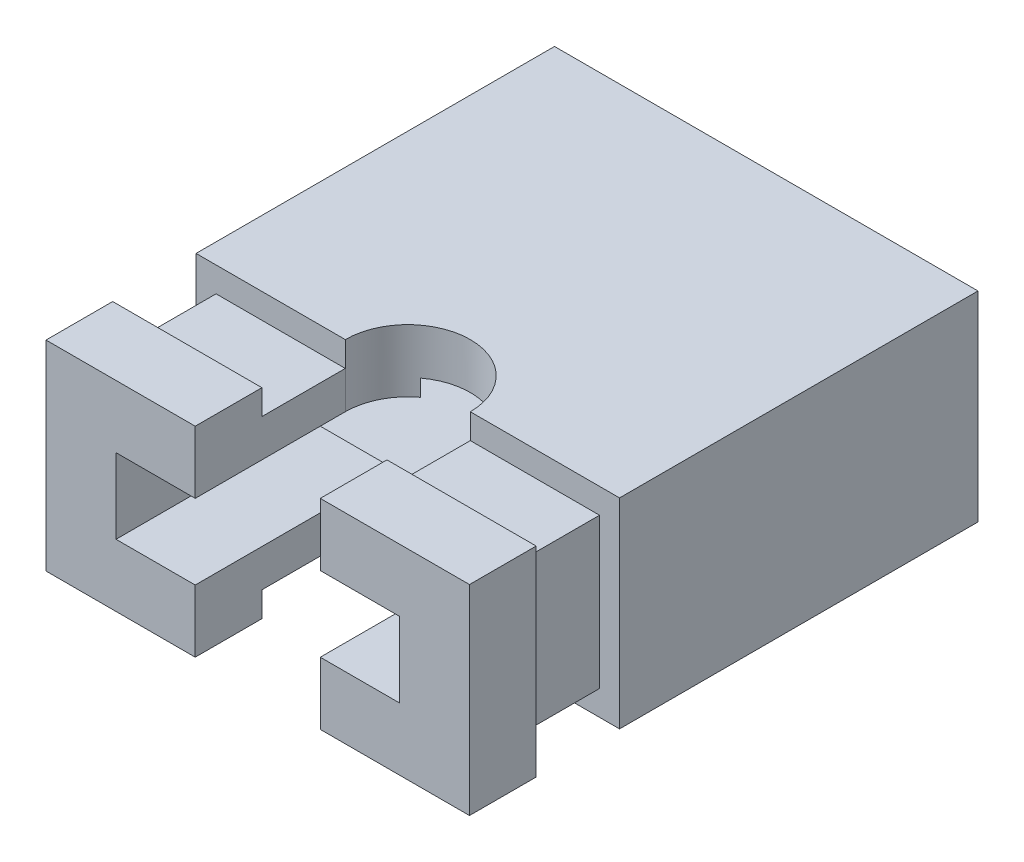
ISO-10303-21;
HEADER;
FILE_DESCRIPTION(('STEP AP214'),'2;1');
FILE_NAME('part.step','',(''),(''),'','','');
FILE_SCHEMA(('AUTOMOTIVE_DESIGN { 1 0 10303 214 1 1 1 1 }'));
ENDSEC;
DATA;
#1=APPLICATION_CONTEXT('core data for automotive mechanical design processes');
#2=APPLICATION_PROTOCOL_DEFINITION('international standard','automotive_design',2000,#1);
#3=PRODUCT_CONTEXT('',#1,'mechanical');
#4=PRODUCT('Part','Part','',(#3));
#5=PRODUCT_RELATED_PRODUCT_CATEGORY('part','',(#4));
#6=PRODUCT_DEFINITION_FORMATION('','',#4);
#7=PRODUCT_DEFINITION_CONTEXT('part definition',#1,'design');
#8=PRODUCT_DEFINITION('design','',#6,#7);
#9=PRODUCT_DEFINITION_SHAPE('','',#8);
#10=(LENGTH_UNIT() NAMED_UNIT(*) SI_UNIT(.MILLI.,.METRE.));
#11=(NAMED_UNIT(*) PLANE_ANGLE_UNIT() SI_UNIT($,.RADIAN.));
#12=(NAMED_UNIT(*) SI_UNIT($,.STERADIAN.) SOLID_ANGLE_UNIT());
#13=UNCERTAINTY_MEASURE_WITH_UNIT(LENGTH_MEASURE(1.E-05),#10,'distance_accuracy_value','');
#14=(GEOMETRIC_REPRESENTATION_CONTEXT(3) GLOBAL_UNCERTAINTY_ASSIGNED_CONTEXT((#13)) GLOBAL_UNIT_ASSIGNED_CONTEXT((#10,
#11,#12)) REPRESENTATION_CONTEXT('',''));
#15=CARTESIAN_POINT('',(0.,0.,0.));
#16=DIRECTION('',(0.,0.,1.));
#17=DIRECTION('',(1.,0.,0.));
#18=AXIS2_PLACEMENT_3D('',#15,#16,#17);
#19=CARTESIAN_POINT('',(-2.54,1.2,4.3));
#20=DIRECTION('',(0.,0.,-1.));
#21=DIRECTION('',(-1.,0.,0.));
#22=AXIS2_PLACEMENT_3D('',#19,#20,#21);
#23=PLANE('',#22);
#24=DIRECTION('',(-1.,0.,0.));
#25=VECTOR('',#24,1.);
#26=CARTESIAN_POINT('',(-2.54,1.2,4.3));
#27=LINE('',#26,#25);
#28=CARTESIAN_POINT('',(2.54,1.2,4.3));
#29=VERTEX_POINT('',#28);
#30=CARTESIAN_POINT('',(0.750000000000007,1.2,4.29999999999999));
#31=VERTEX_POINT('',#30);
#32=EDGE_CURVE('E385',#29,#31,#27,.T.);
#33=ORIENTED_EDGE('',*,*,#32,.T.);
#34=DIRECTION('',(0.,-1.,0.));
#35=VECTOR('',#34,1.);
#36=CARTESIAN_POINT('',(0.750000000000007,1.80000000000001,4.29999999999999));
#37=LINE('',#36,#35);
#38=CARTESIAN_POINT('',(0.750000000000007,0.9,4.29999999999999));
#39=VERTEX_POINT('',#38);
#40=EDGE_CURVE('E552',#31,#39,#37,.T.);
#41=ORIENTED_EDGE('',*,*,#40,.T.);
#42=DIRECTION('',(-1.,0.,0.));
#43=VECTOR('',#42,1.);
#44=CARTESIAN_POINT('',(-2.3,0.9,4.3));
#45=LINE('',#44,#43);
#46=CARTESIAN_POINT('',(2.3,0.9,4.3));
#47=VERTEX_POINT('',#46);
#48=EDGE_CURVE('E337',#47,#39,#45,.T.);
#49=ORIENTED_EDGE('',*,*,#48,.F.);
#50=DIRECTION('',(0.,1.,0.));
#51=VECTOR('',#50,1.);
#52=CARTESIAN_POINT('',(2.3,0.9,4.3));
#53=LINE('',#52,#51);
#54=CARTESIAN_POINT('',(2.3,-0.9,4.3));
#55=VERTEX_POINT('',#54);
#56=EDGE_CURVE('E333',#55,#47,#53,.T.);
#57=ORIENTED_EDGE('',*,*,#56,.F.);
#58=DIRECTION('',(1.,0.,0.));
#59=VECTOR('',#58,1.);
#60=CARTESIAN_POINT('',(2.3,-0.899999999999999,4.3));
#61=LINE('',#60,#59);
#62=CARTESIAN_POINT('',(0.750000000000007,-0.9,4.29999999999999));
#63=VERTEX_POINT('',#62);
#64=EDGE_CURVE('E329',#63,#55,#61,.T.);
#65=ORIENTED_EDGE('',*,*,#64,.F.);
#66=CARTESIAN_POINT('',(0.750000000000007,-1.19999999999999,4.29999999999999));
#67=VERTEX_POINT('',#66);
#68=EDGE_CURVE('E548',#63,#67,#37,.T.);
#69=ORIENTED_EDGE('',*,*,#68,.T.);
#70=DIRECTION('',(1.,0.,0.));
#71=VECTOR('',#70,1.);
#72=CARTESIAN_POINT('',(2.54,-1.19999999999999,4.3));
#73=LINE('',#72,#71);
#74=CARTESIAN_POINT('',(2.54,-1.19999999999999,4.3));
#75=VERTEX_POINT('',#74);
#76=EDGE_CURVE('E378',#67,#75,#73,.T.);
#77=ORIENTED_EDGE('',*,*,#76,.T.);
#78=DIRECTION('',(0.,1.,0.));
#79=VECTOR('',#78,1.);
#80=CARTESIAN_POINT('',(2.54,1.2,4.3));
#81=LINE('',#80,#79);
#82=EDGE_CURVE('E382',#75,#29,#81,.T.);
#83=ORIENTED_EDGE('',*,*,#82,.T.);
#84=EDGE_LOOP('',(#33,#41,#49,#57,#65,#69,#77,#83));
#85=FACE_BOUND('',#84,.T.);
#86=ADVANCED_FACE('F34',(#85),#23,.F.);
#87=CARTESIAN_POINT('',(2.3,-0.899999999999999,5.3));
#88=DIRECTION('',(0.,1.,0.));
#89=DIRECTION('',(-1.,0.,0.));
#90=AXIS2_PLACEMENT_3D('',#87,#88,#89);
#91=PLANE('',#90);
#92=DIRECTION('',(1.,0.,0.));
#93=VECTOR('',#92,1.);
#94=CARTESIAN_POINT('',(2.3,-0.899999999999999,5.3));
#95=LINE('',#94,#93);
#96=CARTESIAN_POINT('',(0.750000000000006,-0.9,5.3));
#97=VERTEX_POINT('',#96);
#98=CARTESIAN_POINT('',(2.3,-0.899999999999999,5.3));
#99=VERTEX_POINT('',#98);
#100=EDGE_CURVE('E343',#97,#99,#95,.T.);
#101=ORIENTED_EDGE('',*,*,#100,.F.);
#102=DIRECTION('',(0.,0.,-1.));
#103=VECTOR('',#102,1.);
#104=CARTESIAN_POINT('',(0.750000000000006,-0.9,5.29999999999999));
#105=LINE('',#104,#103);
#106=EDGE_CURVE('E667',#97,#63,#105,.T.);
#107=ORIENTED_EDGE('',*,*,#106,.T.);
#108=ORIENTED_EDGE('',*,*,#64,.T.);
#109=DIRECTION('',(0.,0.,-1.));
#110=VECTOR('',#109,1.);
#111=CARTESIAN_POINT('',(2.3,-0.899999999999999,5.3));
#112=LINE('',#111,#110);
#113=EDGE_CURVE('E360',#99,#55,#112,.T.);
#114=ORIENTED_EDGE('',*,*,#113,.F.);
#115=EDGE_LOOP('',(#101,#107,#108,#114));
#116=FACE_BOUND('',#115,.T.);
#117=ADVANCED_FACE('F616',(#116),#91,.F.);
#118=CARTESIAN_POINT('',(-2.54,1.2,5.3));
#119=DIRECTION('',(0.,0.,-1.));
#120=DIRECTION('',(-1.,0.,0.));
#121=AXIS2_PLACEMENT_3D('',#118,#119,#120);
#122=PLANE('',#121);
#123=DIRECTION('',(0.,-1.,0.));
#124=VECTOR('',#123,1.);
#125=CARTESIAN_POINT('',(0.750000000000006,1.2,5.3));
#126=LINE('',#125,#124);
#127=CARTESIAN_POINT('',(0.750000000000006,1.2,5.3));
#128=VERTEX_POINT('',#127);
#129=CARTESIAN_POINT('',(0.750000000000006,0.9,5.3));
#130=VERTEX_POINT('',#129);
#131=EDGE_CURVE('E676',#128,#130,#126,.T.);
#132=ORIENTED_EDGE('',*,*,#131,.F.);
#133=DIRECTION('',(-1.,0.,0.));
#134=VECTOR('',#133,1.);
#135=CARTESIAN_POINT('',(-2.54,1.2,5.3));
#136=LINE('',#135,#134);
#137=CARTESIAN_POINT('',(2.54,1.2,5.3));
#138=VERTEX_POINT('',#137);
#139=EDGE_CURVE('E495',#138,#128,#136,.T.);
#140=ORIENTED_EDGE('',*,*,#139,.F.);
#141=DIRECTION('',(0.,1.,0.));
#142=VECTOR('',#141,1.);
#143=CARTESIAN_POINT('',(2.54,1.2,5.3));
#144=LINE('',#143,#142);
#145=CARTESIAN_POINT('',(2.54,-1.19999999999999,5.3));
#146=VERTEX_POINT('',#145);
#147=EDGE_CURVE('E493',#146,#138,#144,.T.);
#148=ORIENTED_EDGE('',*,*,#147,.F.);
#149=DIRECTION('',(1.,0.,0.));
#150=VECTOR('',#149,1.);
#151=CARTESIAN_POINT('',(2.54,-1.19999999999999,5.3));
#152=LINE('',#151,#150);
#153=CARTESIAN_POINT('',(0.750000000000006,-1.19999999999999,5.3));
#154=VERTEX_POINT('',#153);
#155=EDGE_CURVE('E491',#154,#146,#152,.T.);
#156=ORIENTED_EDGE('',*,*,#155,.F.);
#157=EDGE_CURVE('E672',#97,#154,#126,.T.);
#158=ORIENTED_EDGE('',*,*,#157,.F.);
#159=ORIENTED_EDGE('',*,*,#100,.T.);
#160=DIRECTION('',(0.,1.,0.));
#161=VECTOR('',#160,1.);
#162=CARTESIAN_POINT('',(2.3,0.9,5.3));
#163=LINE('',#162,#161);
#164=CARTESIAN_POINT('',(2.3,0.9,5.3));
#165=VERTEX_POINT('',#164);
#166=EDGE_CURVE('E347',#99,#165,#163,.T.);
#167=ORIENTED_EDGE('',*,*,#166,.T.);
#168=DIRECTION('',(-1.,0.,0.));
#169=VECTOR('',#168,1.);
#170=CARTESIAN_POINT('',(-2.3,0.9,5.3));
#171=LINE('',#170,#169);
#172=EDGE_CURVE('E351',#165,#130,#171,.T.);
#173=ORIENTED_EDGE('',*,*,#172,.T.);
#174=EDGE_LOOP('',(#132,#140,#148,#156,#158,#159,#167,#173));
#175=FACE_BOUND('',#174,.T.);
#176=ADVANCED_FACE('F608',(#175),#122,.T.);
#177=CARTESIAN_POINT('',(2.54,-1.19999999999999,6.1));
#178=DIRECTION('',(0.,1.,0.));
#179=DIRECTION('',(0.,0.,1.));
#180=AXIS2_PLACEMENT_3D('',#177,#178,#179);
#181=PLANE('',#180);
#182=DIRECTION('',(1.,0.,0.));
#183=VECTOR('',#182,1.);
#184=CARTESIAN_POINT('',(2.54,-1.19999999999999,6.1));
#185=LINE('',#184,#183);
#186=CARTESIAN_POINT('',(0.75,-1.19999999999999,6.1));
#187=VERTEX_POINT('',#186);
#188=CARTESIAN_POINT('',(2.54,-1.19999999999999,6.1));
#189=VERTEX_POINT('',#188);
#190=EDGE_CURVE('E305',#187,#189,#185,.T.);
#191=ORIENTED_EDGE('',*,*,#190,.F.);
#192=DIRECTION('',(0.,0.,1.));
#193=VECTOR('',#192,1.);
#194=CARTESIAN_POINT('',(0.75,-1.19999999999999,6.1));
#195=LINE('',#194,#193);
#196=EDGE_CURVE('E289',#154,#187,#195,.T.);
#197=ORIENTED_EDGE('',*,*,#196,.F.);
#198=ORIENTED_EDGE('',*,*,#155,.T.);
#199=DIRECTION('',(0.,0.,-1.));
#200=VECTOR('',#199,1.);
#201=CARTESIAN_POINT('',(2.54,-1.19999999999999,6.1));
#202=LINE('',#201,#200);
#203=EDGE_CURVE('E321',#189,#146,#202,.T.);
#204=ORIENTED_EDGE('',*,*,#203,.F.);
#205=EDGE_LOOP('',(#191,#197,#198,#204));
#206=FACE_BOUND('',#205,.T.);
#207=ADVANCED_FACE('F613',(#206),#181,.F.);
#208=CARTESIAN_POINT('',(-2.3,0.9,5.3));
#209=DIRECTION('',(0.,-1.,0.));
#210=DIRECTION('',(0.,0.,-1.));
#211=AXIS2_PLACEMENT_3D('',#208,#209,#210);
#212=PLANE('',#211);
#213=ORIENTED_EDGE('',*,*,#48,.T.);
#214=DIRECTION('',(0.,0.,1.));
#215=VECTOR('',#214,1.);
#216=CARTESIAN_POINT('',(0.750000000000006,0.9,5.30000000000002));
#217=LINE('',#216,#215);
#218=EDGE_CURVE('E673',#39,#130,#217,.T.);
#219=ORIENTED_EDGE('',*,*,#218,.T.);
#220=ORIENTED_EDGE('',*,*,#172,.F.);
#221=DIRECTION('',(0.,0.,-1.));
#222=VECTOR('',#221,1.);
#223=CARTESIAN_POINT('',(2.3,0.9,5.3));
#224=LINE('',#223,#222);
#225=EDGE_CURVE('E357',#165,#47,#224,.T.);
#226=ORIENTED_EDGE('',*,*,#225,.T.);
#227=EDGE_LOOP('',(#213,#219,#220,#226));
#228=FACE_BOUND('',#227,.T.);
#229=ADVANCED_FACE('F602',(#228),#212,.F.);
#230=CARTESIAN_POINT('',(-2.54,1.2,6.1));
#231=DIRECTION('',(0.,-1.,0.));
#232=DIRECTION('',(0.,0.,-1.));
#233=AXIS2_PLACEMENT_3D('',#230,#231,#232);
#234=PLANE('',#233);
#235=DIRECTION('',(-1.,0.,0.));
#236=VECTOR('',#235,1.);
#237=CARTESIAN_POINT('',(-2.54,1.2,6.1));
#238=LINE('',#237,#236);
#239=CARTESIAN_POINT('',(-0.75,1.2,6.1));
#240=VERTEX_POINT('',#239);
#241=CARTESIAN_POINT('',(-2.54,1.2,6.1));
#242=VERTEX_POINT('',#241);
#243=EDGE_CURVE('E307',#240,#242,#238,.T.);
#244=ORIENTED_EDGE('',*,*,#243,.F.);
#245=DIRECTION('',(0.,0.,-1.));
#246=VECTOR('',#245,1.);
#247=CARTESIAN_POINT('',(-0.75,1.2,6.1));
#248=LINE('',#247,#246);
#249=CARTESIAN_POINT('',(-0.75,1.2,5.3));
#250=VERTEX_POINT('',#249);
#251=EDGE_CURVE('E506',#240,#250,#248,.T.);
#252=ORIENTED_EDGE('',*,*,#251,.T.);
#253=CARTESIAN_POINT('',(-2.54,1.2,5.3));
#254=VERTEX_POINT('',#253);
#255=EDGE_CURVE('E494',#250,#254,#136,.T.);
#256=ORIENTED_EDGE('',*,*,#255,.T.);
#257=DIRECTION('',(0.,0.,-1.));
#258=VECTOR('',#257,1.);
#259=CARTESIAN_POINT('',(-2.54,1.2,6.1));
#260=LINE('',#259,#258);
#261=EDGE_CURVE('E315',#242,#254,#260,.T.);
#262=ORIENTED_EDGE('',*,*,#261,.F.);
#263=EDGE_LOOP('',(#244,#252,#256,#262));
#264=FACE_BOUND('',#263,.T.);
#265=ADVANCED_FACE('F505',(#264),#234,.F.);
#266=CARTESIAN_POINT('',(-2.54,1.2,6.1));
#267=DIRECTION('',(0.,0.,-1.));
#268=DIRECTION('',(-1.,0.,0.));
#269=AXIS2_PLACEMENT_3D('',#266,#267,#268);
#270=PLANE('',#269);
#271=CARTESIAN_POINT('',(2.54,1.2,6.1));
#272=VERTEX_POINT('',#271);
#273=CARTESIAN_POINT('',(0.75,1.2,6.1));
#274=VERTEX_POINT('',#273);
#275=EDGE_CURVE('E312',#272,#274,#238,.T.);
#276=ORIENTED_EDGE('',*,*,#275,.T.);
#277=DIRECTION('',(0.,-1.,0.));
#278=VECTOR('',#277,1.);
#279=CARTESIAN_POINT('',(0.75,1.80000000000001,6.1));
#280=LINE('',#279,#278);
#281=CARTESIAN_POINT('',(0.75,0.45,6.1));
#282=VERTEX_POINT('',#281);
#283=EDGE_CURVE('E542',#274,#282,#280,.T.);
#284=ORIENTED_EDGE('',*,*,#283,.T.);
#285=DIRECTION('',(1.,0.,0.));
#286=VECTOR('',#285,1.);
#287=CARTESIAN_POINT('',(-2.54,0.45,6.1));
#288=LINE('',#287,#286);
#289=CARTESIAN_POINT('',(1.7,0.45,6.1));
#290=VERTEX_POINT('',#289);
#291=EDGE_CURVE('E407',#282,#290,#288,.T.);
#292=ORIENTED_EDGE('',*,*,#291,.T.);
#293=DIRECTION('',(0.,-1.,0.));
#294=VECTOR('',#293,1.);
#295=CARTESIAN_POINT('',(1.7,1.2,6.1));
#296=LINE('',#295,#294);
#297=CARTESIAN_POINT('',(1.7,-0.45,6.1));
#298=VERTEX_POINT('',#297);
#299=EDGE_CURVE('E404',#290,#298,#296,.T.);
#300=ORIENTED_EDGE('',*,*,#299,.T.);
#301=DIRECTION('',(-1.,0.,0.));
#302=VECTOR('',#301,1.);
#303=CARTESIAN_POINT('',(-2.54,-0.45,6.1));
#304=LINE('',#303,#302);
#305=CARTESIAN_POINT('',(0.75,-0.45,6.1));
#306=VERTEX_POINT('',#305);
#307=EDGE_CURVE('E401',#298,#306,#304,.T.);
#308=ORIENTED_EDGE('',*,*,#307,.T.);
#309=EDGE_CURVE('E553',#306,#187,#280,.T.);
#310=ORIENTED_EDGE('',*,*,#309,.T.);
#311=ORIENTED_EDGE('',*,*,#190,.T.);
#312=DIRECTION('',(0.,1.,0.));
#313=VECTOR('',#312,1.);
#314=CARTESIAN_POINT('',(2.54,1.2,6.1));
#315=LINE('',#314,#313);
#316=EDGE_CURVE('E304',#189,#272,#315,.T.);
#317=ORIENTED_EDGE('',*,*,#316,.T.);
#318=EDGE_LOOP('',(#276,#284,#292,#300,#308,#310,#311,#317));
#319=FACE_BOUND('',#318,.T.);
#320=ADVANCED_FACE('F691',(#319),#270,.F.);
#321=CARTESIAN_POINT('',(1.7,0.45,8.7));
#322=DIRECTION('',(0.,1.,0.));
#323=DIRECTION('',(0.,0.,1.));
#324=AXIS2_PLACEMENT_3D('',#321,#322,#323);
#325=PLANE('',#324);
#326=ORIENTED_EDGE('',*,*,#291,.F.);
#327=DIRECTION('',(0.,0.,-1.));
#328=VECTOR('',#327,1.);
#329=CARTESIAN_POINT('',(0.749999999999979,0.45,8.69999999999999));
#330=LINE('',#329,#328);
#331=CARTESIAN_POINT('',(0.750000000000007,0.45,4.29999999999999));
#332=VERTEX_POINT('',#331);
#333=EDGE_CURVE('E518',#282,#332,#330,.T.);
#334=ORIENTED_EDGE('',*,*,#333,.T.);
#335=CARTESIAN_POINT('',(0.,0.45,4.3));
#336=DIRECTION('',(0.,1.,0.));
#337=DIRECTION('',(0.,0.,1.));
#338=AXIS2_PLACEMENT_3D('',#335,#336,#337);
#339=CIRCLE('',#338,0.750000000000007);
#340=CARTESIAN_POINT('',(0.450000000000012,0.45,3.7));
#341=VERTEX_POINT('',#340);
#342=EDGE_CURVE('E540',#332,#341,#339,.T.);
#343=ORIENTED_EDGE('',*,*,#342,.T.);
#344=DIRECTION('',(1.,0.,0.));
#345=VECTOR('',#344,1.);
#346=CARTESIAN_POINT('',(1.7,0.45,3.7));
#347=LINE('',#346,#345);
#348=CARTESIAN_POINT('',(1.7,0.45,3.7));
#349=VERTEX_POINT('',#348);
#350=EDGE_CURVE('E442',#341,#349,#347,.T.);
#351=ORIENTED_EDGE('',*,*,#350,.T.);
#352=DIRECTION('',(0.,0.,-1.));
#353=VECTOR('',#352,1.);
#354=CARTESIAN_POINT('',(1.7,0.45,8.7));
#355=LINE('',#354,#353);
#356=EDGE_CURVE('E451',#290,#349,#355,.T.);
#357=ORIENTED_EDGE('',*,*,#356,.F.);
#358=EDGE_LOOP('',(#326,#334,#343,#351,#357));
#359=FACE_BOUND('',#358,.T.);
#360=ADVANCED_FACE('F637',(#359),#325,.F.);
#361=CARTESIAN_POINT('',(-1.7,-0.45,8.7));
#362=DIRECTION('',(0.,-1.,0.));
#363=DIRECTION('',(0.,0.,-1.));
#364=AXIS2_PLACEMENT_3D('',#361,#362,#363);
#365=PLANE('',#364);
#366=CARTESIAN_POINT('',(-0.75,-0.45,6.1));
#367=VERTEX_POINT('',#366);
#368=CARTESIAN_POINT('',(-1.7,-0.45,6.1));
#369=VERTEX_POINT('',#368);
#370=EDGE_CURVE('E400',#367,#369,#304,.T.);
#371=ORIENTED_EDGE('',*,*,#370,.F.);
#372=DIRECTION('',(0.,0.,-1.));
#373=VECTOR('',#372,1.);
#374=CARTESIAN_POINT('',(-0.75,-0.45,8.7));
#375=LINE('',#374,#373);
#376=CARTESIAN_POINT('',(-0.75,-0.45,4.3));
#377=VERTEX_POINT('',#376);
#378=EDGE_CURVE('E11',#367,#377,#375,.T.);
#379=ORIENTED_EDGE('',*,*,#378,.T.);
#380=CARTESIAN_POINT('',(0.,-0.45,4.3));
#381=DIRECTION('',(0.,-1.,0.));
#382=DIRECTION('',(0.,0.,-1.));
#383=AXIS2_PLACEMENT_3D('',#380,#381,#382);
#384=CIRCLE('',#383,0.750000000000007);
#385=CARTESIAN_POINT('',(-0.450000000000012,-0.45,3.7));
#386=VERTEX_POINT('',#385);
#387=EDGE_CURVE('E534',#377,#386,#384,.T.);
#388=ORIENTED_EDGE('',*,*,#387,.T.);
#389=DIRECTION('',(-1.,0.,0.));
#390=VECTOR('',#389,1.);
#391=CARTESIAN_POINT('',(-1.7,-0.45,3.7));
#392=LINE('',#391,#390);
#393=CARTESIAN_POINT('',(-1.7,-0.45,3.7));
#394=VERTEX_POINT('',#393);
#395=EDGE_CURVE('E663',#386,#394,#392,.T.);
#396=ORIENTED_EDGE('',*,*,#395,.T.);
#397=DIRECTION('',(0.,0.,-1.));
#398=VECTOR('',#397,1.);
#399=CARTESIAN_POINT('',(-1.7,-0.45,8.7));
#400=LINE('',#399,#398);
#401=EDGE_CURVE('E445',#369,#394,#400,.T.);
#402=ORIENTED_EDGE('',*,*,#401,.F.);
#403=EDGE_LOOP('',(#371,#379,#388,#396,#402));
#404=FACE_BOUND('',#403,.T.);
#405=ADVANCED_FACE('F631',(#404),#365,.F.);
#406=CARTESIAN_POINT('',(1.9,0.65,3.7));
#407=DIRECTION('',(0.,0.,1.));
#408=DIRECTION('',(1.,0.,0.));
#409=AXIS2_PLACEMENT_3D('',#406,#407,#408);
#410=PLANE('',#409);
#411=DIRECTION('',(1.,0.,0.));
#412=VECTOR('',#411,1.);
#413=CARTESIAN_POINT('',(1.9,0.65,3.7));
#414=LINE('',#413,#412);
#415=CARTESIAN_POINT('',(-1.9,0.65,3.7));
#416=VERTEX_POINT('',#415);
#417=CARTESIAN_POINT('',(-0.450000000000012,0.65,3.7));
#418=VERTEX_POINT('',#417);
#419=EDGE_CURVE('E432',#416,#418,#414,.T.);
#420=ORIENTED_EDGE('',*,*,#419,.T.);
#421=DIRECTION('',(0.,-1.,0.));
#422=VECTOR('',#421,1.);
#423=CARTESIAN_POINT('',(-0.450000000000012,1.80000000000001,3.7));
#424=LINE('',#423,#422);
#425=CARTESIAN_POINT('',(-0.450000000000012,0.45,3.7));
#426=VERTEX_POINT('',#425);
#427=EDGE_CURVE('E419',#418,#426,#424,.T.);
#428=ORIENTED_EDGE('',*,*,#427,.T.);
#429=CARTESIAN_POINT('',(-1.7,0.45,3.7));
#430=VERTEX_POINT('',#429);
#431=EDGE_CURVE('E429',#430,#426,#347,.T.);
#432=ORIENTED_EDGE('',*,*,#431,.F.);
#433=DIRECTION('',(0.,1.,0.));
#434=VECTOR('',#433,1.);
#435=CARTESIAN_POINT('',(-1.7,0.45,3.7));
#436=LINE('',#435,#434);
#437=EDGE_CURVE('E447',#394,#430,#436,.T.);
#438=ORIENTED_EDGE('',*,*,#437,.F.);
#439=ORIENTED_EDGE('',*,*,#395,.F.);
#440=CARTESIAN_POINT('',(-0.450000000000012,-0.65,3.7));
#441=VERTEX_POINT('',#440);
#442=EDGE_CURVE('E417',#386,#441,#424,.T.);
#443=ORIENTED_EDGE('',*,*,#442,.T.);
#444=DIRECTION('',(-1.,0.,0.));
#445=VECTOR('',#444,1.);
#446=CARTESIAN_POINT('',(-1.9,-0.65,3.7));
#447=LINE('',#446,#445);
#448=CARTESIAN_POINT('',(-1.9,-0.65,3.7));
#449=VERTEX_POINT('',#448);
#450=EDGE_CURVE('E471',#441,#449,#447,.T.);
#451=ORIENTED_EDGE('',*,*,#450,.T.);
#452=DIRECTION('',(0.,1.,0.));
#453=VECTOR('',#452,1.);
#454=CARTESIAN_POINT('',(-1.9,0.65,3.7));
#455=LINE('',#454,#453);
#456=EDGE_CURVE('E475',#449,#416,#455,.T.);
#457=ORIENTED_EDGE('',*,*,#456,.T.);
#458=EDGE_LOOP('',(#420,#428,#432,#438,#439,#443,#451,#457));
#459=FACE_BOUND('',#458,.T.);
#460=ADVANCED_FACE('F427',(#459),#410,.F.);
#461=CARTESIAN_POINT('',(-2.54,-1.19999999999999,4.3));
#462=VERTEX_POINT('',#461);
#463=CARTESIAN_POINT('',(-0.75,-1.19999999999999,4.3));
#464=VERTEX_POINT('',#463);
#465=EDGE_CURVE('E379',#462,#464,#73,.T.);
#466=ORIENTED_EDGE('',*,*,#465,.T.);
#467=DIRECTION('',(0.,-1.,0.));
#468=VECTOR('',#467,1.);
#469=CARTESIAN_POINT('',(-0.75,1.80000000000001,4.3));
#470=LINE('',#469,#468);
#471=CARTESIAN_POINT('',(-0.75,-0.9,4.3));
#472=VERTEX_POINT('',#471);
#473=EDGE_CURVE('E544',#472,#464,#470,.T.);
#474=ORIENTED_EDGE('',*,*,#473,.F.);
#475=CARTESIAN_POINT('',(-2.3,-0.9,4.3));
#476=VERTEX_POINT('',#475);
#477=EDGE_CURVE('E330',#476,#472,#61,.T.);
#478=ORIENTED_EDGE('',*,*,#477,.F.);
#479=DIRECTION('',(0.,-1.,0.));
#480=VECTOR('',#479,1.);
#481=CARTESIAN_POINT('',(-2.3,-0.9,4.3));
#482=LINE('',#481,#480);
#483=CARTESIAN_POINT('',(-2.3,0.9,4.3));
#484=VERTEX_POINT('',#483);
#485=EDGE_CURVE('E326',#484,#476,#482,.T.);
#486=ORIENTED_EDGE('',*,*,#485,.F.);
#487=CARTESIAN_POINT('',(-0.75,0.9,4.3));
#488=VERTEX_POINT('',#487);
#489=EDGE_CURVE('E336',#488,#484,#45,.T.);
#490=ORIENTED_EDGE('',*,*,#489,.F.);
#491=CARTESIAN_POINT('',(-0.75,1.2,4.3));
#492=VERTEX_POINT('',#491);
#493=EDGE_CURVE('E547',#492,#488,#470,.T.);
#494=ORIENTED_EDGE('',*,*,#493,.F.);
#495=CARTESIAN_POINT('',(-2.54,1.2,4.3));
#496=VERTEX_POINT('',#495);
#497=EDGE_CURVE('E384',#492,#496,#27,.T.);
#498=ORIENTED_EDGE('',*,*,#497,.T.);
#499=DIRECTION('',(0.,-1.,0.));
#500=VECTOR('',#499,1.);
#501=CARTESIAN_POINT('',(-2.54,-1.19999999999999,4.3));
#502=LINE('',#501,#500);
#503=EDGE_CURVE('E375',#496,#462,#502,.T.);
#504=ORIENTED_EDGE('',*,*,#503,.T.);
#505=EDGE_LOOP('',(#466,#474,#478,#486,#490,#494,#498,#504));
#506=FACE_BOUND('',#505,.T.);
#507=ADVANCED_FACE('F587',(#506),#23,.F.);
#508=CARTESIAN_POINT('',(-2.54,-1.19999999999999,4.3));
#509=DIRECTION('',(1.,0.,0.));
#510=DIRECTION('',(0.,0.,-1.));
#511=AXIS2_PLACEMENT_3D('',#508,#509,#510);
#512=PLANE('',#511);
#513=DIRECTION('',(0.,-1.,0.));
#514=VECTOR('',#513,1.);
#515=CARTESIAN_POINT('',(-2.54,-1.19999999999999,0.));
#516=LINE('',#515,#514);
#517=CARTESIAN_POINT('',(-2.54,1.2,0.));
#518=VERTEX_POINT('',#517);
#519=CARTESIAN_POINT('',(-2.54,-1.19999999999999,0.));
#520=VERTEX_POINT('',#519);
#521=EDGE_CURVE('E366',#518,#520,#516,.T.);
#522=ORIENTED_EDGE('',*,*,#521,.T.);
#523=DIRECTION('',(0.,0.,-1.));
#524=VECTOR('',#523,1.);
#525=CARTESIAN_POINT('',(-2.54,-1.19999999999999,4.3));
#526=LINE('',#525,#524);
#527=EDGE_CURVE('E397',#462,#520,#526,.T.);
#528=ORIENTED_EDGE('',*,*,#527,.F.);
#529=ORIENTED_EDGE('',*,*,#503,.F.);
#530=DIRECTION('',(0.,0.,-1.));
#531=VECTOR('',#530,1.);
#532=CARTESIAN_POINT('',(-2.54,1.2,4.3));
#533=LINE('',#532,#531);
#534=EDGE_CURVE('E388',#496,#518,#533,.T.);
#535=ORIENTED_EDGE('',*,*,#534,.T.);
#536=EDGE_LOOP('',(#522,#528,#529,#535));
#537=FACE_BOUND('',#536,.T.);
#538=ADVANCED_FACE('F36',(#537),#512,.F.);
#539=CARTESIAN_POINT('',(2.54,-1.19999999999999,4.3));
#540=DIRECTION('',(0.,1.,0.));
#541=DIRECTION('',(0.,0.,1.));
#542=AXIS2_PLACEMENT_3D('',#539,#540,#541);
#543=PLANE('',#542);
#544=ORIENTED_EDGE('',*,*,#76,.F.);
#545=CARTESIAN_POINT('',(0.,-1.19999999999999,4.3));
#546=DIRECTION('',(0.,-1.,0.));
#547=DIRECTION('',(0.,0.,1.));
#548=AXIS2_PLACEMENT_3D('',#545,#546,#547);
#549=CIRCLE('',#548,0.750000000000007);
#550=EDGE_CURVE('E298',#464,#67,#549,.T.);
#551=ORIENTED_EDGE('',*,*,#550,.F.);
#552=ORIENTED_EDGE('',*,*,#465,.F.);
#553=ORIENTED_EDGE('',*,*,#527,.T.);
#554=DIRECTION('',(1.,0.,0.));
#555=VECTOR('',#554,1.);
#556=CARTESIAN_POINT('',(2.54,-1.19999999999999,0.));
#557=LINE('',#556,#555);
#558=CARTESIAN_POINT('',(2.54,-1.19999999999999,0.));
#559=VERTEX_POINT('',#558);
#560=EDGE_CURVE('E369',#520,#559,#557,.T.);
#561=ORIENTED_EDGE('',*,*,#560,.T.);
#562=DIRECTION('',(0.,0.,-1.));
#563=VECTOR('',#562,1.);
#564=CARTESIAN_POINT('',(2.54,-1.19999999999999,4.3));
#565=LINE('',#564,#563);
#566=EDGE_CURVE('E394',#75,#559,#565,.T.);
#567=ORIENTED_EDGE('',*,*,#566,.F.);
#568=EDGE_LOOP('',(#544,#551,#552,#553,#561,#567));
#569=FACE_BOUND('',#568,.T.);
#570=ADVANCED_FACE('F568',(#569),#543,.F.);
#571=CARTESIAN_POINT('',(2.54,1.2,4.3));
#572=DIRECTION('',(-1.,0.,0.));
#573=DIRECTION('',(0.,0.,1.));
#574=AXIS2_PLACEMENT_3D('',#571,#572,#573);
#575=PLANE('',#574);
#576=DIRECTION('',(0.,1.,0.));
#577=VECTOR('',#576,1.);
#578=CARTESIAN_POINT('',(2.54,1.2,0.));
#579=LINE('',#578,#577);
#580=CARTESIAN_POINT('',(2.54,1.2,0.));
#581=VERTEX_POINT('',#580);
#582=EDGE_CURVE('E371',#559,#581,#579,.T.);
#583=ORIENTED_EDGE('',*,*,#582,.T.);
#584=DIRECTION('',(0.,0.,-1.));
#585=VECTOR('',#584,1.);
#586=CARTESIAN_POINT('',(2.54,1.2,4.3));
#587=LINE('',#586,#585);
#588=EDGE_CURVE('E391',#29,#581,#587,.T.);
#589=ORIENTED_EDGE('',*,*,#588,.F.);
#590=ORIENTED_EDGE('',*,*,#82,.F.);
#591=ORIENTED_EDGE('',*,*,#566,.T.);
#592=EDGE_LOOP('',(#583,#589,#590,#591));
#593=FACE_BOUND('',#592,.T.);
#594=ADVANCED_FACE('F573',(#593),#575,.F.);
#595=CARTESIAN_POINT('',(-2.54,1.2,4.3));
#596=DIRECTION('',(0.,-1.,0.));
#597=DIRECTION('',(0.,0.,-1.));
#598=AXIS2_PLACEMENT_3D('',#595,#596,#597);
#599=PLANE('',#598);
#600=ORIENTED_EDGE('',*,*,#497,.F.);
#601=CARTESIAN_POINT('',(0.,1.2,4.3));
#602=DIRECTION('',(0.,-1.,0.));
#603=DIRECTION('',(0.,0.,-1.));
#604=AXIS2_PLACEMENT_3D('',#601,#602,#603);
#605=CIRCLE('',#604,0.750000000000007);
#606=EDGE_CURVE('E529',#492,#31,#605,.T.);
#607=ORIENTED_EDGE('',*,*,#606,.T.);
#608=ORIENTED_EDGE('',*,*,#32,.F.);
#609=ORIENTED_EDGE('',*,*,#588,.T.);
#610=DIRECTION('',(-1.,0.,0.));
#611=VECTOR('',#610,1.);
#612=CARTESIAN_POINT('',(-2.54,1.2,0.));
#613=LINE('',#612,#611);
#614=EDGE_CURVE('E373',#581,#518,#613,.T.);
#615=ORIENTED_EDGE('',*,*,#614,.T.);
#616=ORIENTED_EDGE('',*,*,#534,.F.);
#617=EDGE_LOOP('',(#600,#607,#608,#609,#615,#616));
#618=FACE_BOUND('',#617,.T.);
#619=ADVANCED_FACE('F578',(#618),#599,.F.);
#620=CARTESIAN_POINT('',(-2.54,1.2,0.));
#621=DIRECTION('',(0.,0.,-1.));
#622=DIRECTION('',(-1.,0.,0.));
#623=AXIS2_PLACEMENT_3D('',#620,#621,#622);
#624=PLANE('',#623);
#625=DIRECTION('',(1.,0.,0.));
#626=VECTOR('',#625,1.);
#627=CARTESIAN_POINT('',(1.9,0.65,0.));
#628=LINE('',#627,#626);
#629=CARTESIAN_POINT('',(-1.9,0.65,0.));
#630=VERTEX_POINT('',#629);
#631=CARTESIAN_POINT('',(1.9,0.65,0.));
#632=VERTEX_POINT('',#631);
#633=EDGE_CURVE('E465',#630,#632,#628,.T.);
#634=ORIENTED_EDGE('',*,*,#633,.F.);
#635=DIRECTION('',(0.,1.,0.));
#636=VECTOR('',#635,1.);
#637=CARTESIAN_POINT('',(-1.9,0.65,0.));
#638=LINE('',#637,#636);
#639=CARTESIAN_POINT('',(-1.9,-0.65,0.));
#640=VERTEX_POINT('',#639);
#641=EDGE_CURVE('E462',#640,#630,#638,.T.);
#642=ORIENTED_EDGE('',*,*,#641,.F.);
#643=DIRECTION('',(-1.,0.,0.));
#644=VECTOR('',#643,1.);
#645=CARTESIAN_POINT('',(-1.9,-0.65,0.));
#646=LINE('',#645,#644);
#647=CARTESIAN_POINT('',(1.9,-0.65,0.));
#648=VERTEX_POINT('',#647);
#649=EDGE_CURVE('E459',#648,#640,#646,.T.);
#650=ORIENTED_EDGE('',*,*,#649,.F.);
#651=DIRECTION('',(0.,-1.,0.));
#652=VECTOR('',#651,1.);
#653=CARTESIAN_POINT('',(1.9,-0.65,0.));
#654=LINE('',#653,#652);
#655=EDGE_CURVE('E454',#632,#648,#654,.T.);
#656=ORIENTED_EDGE('',*,*,#655,.F.);
#657=EDGE_LOOP('',(#634,#642,#650,#656));
#658=FACE_BOUND('',#657,.T.);
#659=ORIENTED_EDGE('',*,*,#521,.F.);
#660=ORIENTED_EDGE('',*,*,#614,.F.);
#661=ORIENTED_EDGE('',*,*,#582,.F.);
#662=ORIENTED_EDGE('',*,*,#560,.F.);
#663=EDGE_LOOP('',(#659,#660,#661,#662));
#664=FACE_BOUND('',#663,.T.);
#665=ADVANCED_FACE('F723',(#658,#664),#624,.T.);
#666=CARTESIAN_POINT('',(-2.3,-0.9,5.3));
#667=DIRECTION('',(1.,0.,0.));
#668=DIRECTION('',(0.,0.,-1.));
#669=AXIS2_PLACEMENT_3D('',#666,#667,#668);
#670=PLANE('',#669);
#671=ORIENTED_EDGE('',*,*,#485,.T.);
#672=DIRECTION('',(0.,0.,-1.));
#673=VECTOR('',#672,1.);
#674=CARTESIAN_POINT('',(-2.3,-0.9,5.3));
#675=LINE('',#674,#673);
#676=CARTESIAN_POINT('',(-2.3,-0.9,5.3));
#677=VERTEX_POINT('',#676);
#678=EDGE_CURVE('E363',#677,#476,#675,.T.);
#679=ORIENTED_EDGE('',*,*,#678,.F.);
#680=DIRECTION('',(0.,-1.,0.));
#681=VECTOR('',#680,1.);
#682=CARTESIAN_POINT('',(-2.3,-0.9,5.3));
#683=LINE('',#682,#681);
#684=CARTESIAN_POINT('',(-2.3,0.9,5.3));
#685=VERTEX_POINT('',#684);
#686=EDGE_CURVE('E340',#685,#677,#683,.T.);
#687=ORIENTED_EDGE('',*,*,#686,.F.);
#688=DIRECTION('',(0.,0.,-1.));
#689=VECTOR('',#688,1.);
#690=CARTESIAN_POINT('',(-2.3,0.9,5.3));
#691=LINE('',#690,#689);
#692=EDGE_CURVE('E354',#685,#484,#691,.T.);
#693=ORIENTED_EDGE('',*,*,#692,.T.);
#694=EDGE_LOOP('',(#671,#679,#687,#693));
#695=FACE_BOUND('',#694,.T.);
#696=ADVANCED_FACE('F596',(#695),#670,.F.);
#697=ORIENTED_EDGE('',*,*,#477,.T.);
#698=DIRECTION('',(0.,0.,1.));
#699=VECTOR('',#698,1.);
#700=CARTESIAN_POINT('',(-0.75,-0.9,5.3));
#701=LINE('',#700,#699);
#702=CARTESIAN_POINT('',(-0.75,-0.9,5.3));
#703=VERTEX_POINT('',#702);
#704=EDGE_CURVE('E515',#472,#703,#701,.T.);
#705=ORIENTED_EDGE('',*,*,#704,.T.);
#706=EDGE_CURVE('E344',#677,#703,#95,.T.);
#707=ORIENTED_EDGE('',*,*,#706,.F.);
#708=ORIENTED_EDGE('',*,*,#678,.T.);
#709=EDGE_LOOP('',(#697,#705,#707,#708));
#710=FACE_BOUND('',#709,.T.);
#711=ADVANCED_FACE('F592',(#710),#91,.F.);
#712=CARTESIAN_POINT('',(2.3,0.9,5.3));
#713=DIRECTION('',(-1.,0.,0.));
#714=DIRECTION('',(0.,0.,1.));
#715=AXIS2_PLACEMENT_3D('',#712,#713,#714);
#716=PLANE('',#715);
#717=ORIENTED_EDGE('',*,*,#56,.T.);
#718=ORIENTED_EDGE('',*,*,#225,.F.);
#719=ORIENTED_EDGE('',*,*,#166,.F.);
#720=ORIENTED_EDGE('',*,*,#113,.T.);
#721=EDGE_LOOP('',(#717,#718,#719,#720));
#722=FACE_BOUND('',#721,.T.);
#723=ADVANCED_FACE('F600',(#722),#716,.F.);
#724=CARTESIAN_POINT('',(-0.75,0.9,5.3));
#725=VERTEX_POINT('',#724);
#726=EDGE_CURVE('E350',#725,#685,#171,.T.);
#727=ORIENTED_EDGE('',*,*,#726,.F.);
#728=DIRECTION('',(0.,0.,-1.));
#729=VECTOR('',#728,1.);
#730=CARTESIAN_POINT('',(-0.75,0.9,5.3));
#731=LINE('',#730,#729);
#732=EDGE_CURVE('E522',#725,#488,#731,.T.);
#733=ORIENTED_EDGE('',*,*,#732,.T.);
#734=ORIENTED_EDGE('',*,*,#489,.T.);
#735=ORIENTED_EDGE('',*,*,#692,.F.);
#736=EDGE_LOOP('',(#727,#733,#734,#735));
#737=FACE_BOUND('',#736,.T.);
#738=ADVANCED_FACE('F598',(#737),#212,.F.);
#739=DIRECTION('',(0.,1.,0.));
#740=VECTOR('',#739,1.);
#741=CARTESIAN_POINT('',(-0.75,1.2,5.3));
#742=LINE('',#741,#740);
#743=CARTESIAN_POINT('',(-0.75,-1.19999999999999,5.3));
#744=VERTEX_POINT('',#743);
#745=EDGE_CURVE('E513',#744,#703,#742,.T.);
#746=ORIENTED_EDGE('',*,*,#745,.F.);
#747=CARTESIAN_POINT('',(-2.54,-1.19999999999999,5.3));
#748=VERTEX_POINT('',#747);
#749=EDGE_CURVE('E297',#748,#744,#152,.T.);
#750=ORIENTED_EDGE('',*,*,#749,.F.);
#751=DIRECTION('',(0.,-1.,0.));
#752=VECTOR('',#751,1.);
#753=CARTESIAN_POINT('',(-2.54,-1.19999999999999,5.3));
#754=LINE('',#753,#752);
#755=EDGE_CURVE('E482',#254,#748,#754,.T.);
#756=ORIENTED_EDGE('',*,*,#755,.F.);
#757=ORIENTED_EDGE('',*,*,#255,.F.);
#758=EDGE_CURVE('E517',#725,#250,#742,.T.);
#759=ORIENTED_EDGE('',*,*,#758,.F.);
#760=ORIENTED_EDGE('',*,*,#726,.T.);
#761=ORIENTED_EDGE('',*,*,#686,.T.);
#762=ORIENTED_EDGE('',*,*,#706,.T.);
#763=EDGE_LOOP('',(#746,#750,#756,#757,#759,#760,#761,#762));
#764=FACE_BOUND('',#763,.T.);
#765=ADVANCED_FACE('F512',(#764),#122,.T.);
#766=CARTESIAN_POINT('',(-2.54,-1.19999999999999,6.1));
#767=DIRECTION('',(1.,0.,0.));
#768=DIRECTION('',(0.,0.,-1.));
#769=AXIS2_PLACEMENT_3D('',#766,#767,#768);
#770=PLANE('',#769);
#771=ORIENTED_EDGE('',*,*,#755,.T.);
#772=DIRECTION('',(0.,0.,-1.));
#773=VECTOR('',#772,1.);
#774=CARTESIAN_POINT('',(-2.54,-1.19999999999999,6.1));
#775=LINE('',#774,#773);
#776=CARTESIAN_POINT('',(-2.54,-1.19999999999999,6.1));
#777=VERTEX_POINT('',#776);
#778=EDGE_CURVE('E324',#777,#748,#775,.T.);
#779=ORIENTED_EDGE('',*,*,#778,.F.);
#780=DIRECTION('',(0.,-1.,0.));
#781=VECTOR('',#780,1.);
#782=CARTESIAN_POINT('',(-2.54,-1.19999999999999,6.1));
#783=LINE('',#782,#781);
#784=EDGE_CURVE('E302',#242,#777,#783,.T.);
#785=ORIENTED_EDGE('',*,*,#784,.F.);
#786=ORIENTED_EDGE('',*,*,#261,.T.);
#787=EDGE_LOOP('',(#771,#779,#785,#786));
#788=FACE_BOUND('',#787,.T.);
#789=ADVANCED_FACE('F511',(#788),#770,.F.);
#790=ORIENTED_EDGE('',*,*,#749,.T.);
#791=DIRECTION('',(0.,0.,-1.));
#792=VECTOR('',#791,1.);
#793=CARTESIAN_POINT('',(-0.75,-1.19999999999999,6.1));
#794=LINE('',#793,#792);
#795=CARTESIAN_POINT('',(-0.75,-1.19999999999999,6.1));
#796=VERTEX_POINT('',#795);
#797=EDGE_CURVE('E283',#796,#744,#794,.T.);
#798=ORIENTED_EDGE('',*,*,#797,.F.);
#799=EDGE_CURVE('E295',#777,#796,#185,.T.);
#800=ORIENTED_EDGE('',*,*,#799,.F.);
#801=ORIENTED_EDGE('',*,*,#778,.T.);
#802=EDGE_LOOP('',(#790,#798,#800,#801));
#803=FACE_BOUND('',#802,.T.);
#804=ADVANCED_FACE('F293',(#803),#181,.F.);
#805=CARTESIAN_POINT('',(2.54,1.2,6.1));
#806=DIRECTION('',(-1.,0.,0.));
#807=DIRECTION('',(0.,0.,1.));
#808=AXIS2_PLACEMENT_3D('',#805,#806,#807);
#809=PLANE('',#808);
#810=ORIENTED_EDGE('',*,*,#147,.T.);
#811=DIRECTION('',(0.,0.,-1.));
#812=VECTOR('',#811,1.);
#813=CARTESIAN_POINT('',(2.54,1.2,6.1));
#814=LINE('',#813,#812);
#815=EDGE_CURVE('E318',#272,#138,#814,.T.);
#816=ORIENTED_EDGE('',*,*,#815,.F.);
#817=ORIENTED_EDGE('',*,*,#316,.F.);
#818=ORIENTED_EDGE('',*,*,#203,.T.);
#819=EDGE_LOOP('',(#810,#816,#817,#818));
#820=FACE_BOUND('',#819,.T.);
#821=ADVANCED_FACE('F740',(#820),#809,.F.);
#822=ORIENTED_EDGE('',*,*,#139,.T.);
#823=DIRECTION('',(0.,0.,1.));
#824=VECTOR('',#823,1.);
#825=CARTESIAN_POINT('',(0.75,1.2,6.10000000000003));
#826=LINE('',#825,#824);
#827=EDGE_CURVE('E678',#128,#274,#826,.T.);
#828=ORIENTED_EDGE('',*,*,#827,.T.);
#829=ORIENTED_EDGE('',*,*,#275,.F.);
#830=ORIENTED_EDGE('',*,*,#815,.T.);
#831=EDGE_LOOP('',(#822,#828,#829,#830));
#832=FACE_BOUND('',#831,.T.);
#833=ADVANCED_FACE('F696',(#832),#234,.F.);
#834=ORIENTED_EDGE('',*,*,#799,.T.);
#835=DIRECTION('',(0.,-1.,0.));
#836=VECTOR('',#835,1.);
#837=CARTESIAN_POINT('',(-0.75,1.80000000000001,6.1));
#838=LINE('',#837,#836);
#839=EDGE_CURVE('E279',#367,#796,#838,.T.);
#840=ORIENTED_EDGE('',*,*,#839,.F.);
#841=ORIENTED_EDGE('',*,*,#370,.T.);
#842=DIRECTION('',(0.,1.,0.));
#843=VECTOR('',#842,1.);
#844=CARTESIAN_POINT('',(-1.7,1.2,6.1));
#845=LINE('',#844,#843);
#846=CARTESIAN_POINT('',(-1.7,0.45,6.1));
#847=VERTEX_POINT('',#846);
#848=EDGE_CURVE('E411',#369,#847,#845,.T.);
#849=ORIENTED_EDGE('',*,*,#848,.T.);
#850=CARTESIAN_POINT('',(-0.75,0.45,6.1));
#851=VERTEX_POINT('',#850);
#852=EDGE_CURVE('E408',#847,#851,#288,.T.);
#853=ORIENTED_EDGE('',*,*,#852,.T.);
#854=EDGE_CURVE('E288',#240,#851,#838,.T.);
#855=ORIENTED_EDGE('',*,*,#854,.F.);
#856=ORIENTED_EDGE('',*,*,#243,.T.);
#857=ORIENTED_EDGE('',*,*,#784,.T.);
#858=EDGE_LOOP('',(#834,#840,#841,#849,#853,#855,#856,#857));
#859=FACE_BOUND('',#858,.T.);
#860=ADVANCED_FACE('F300',(#859),#270,.F.);
#861=CARTESIAN_POINT('',(1.9,-0.65,3.7));
#862=DIRECTION('',(1.,0.,0.));
#863=DIRECTION('',(0.,1.,0.));
#864=AXIS2_PLACEMENT_3D('',#861,#862,#863);
#865=PLANE('',#864);
#866=ORIENTED_EDGE('',*,*,#655,.T.);
#867=DIRECTION('',(0.,0.,-1.));
#868=VECTOR('',#867,1.);
#869=CARTESIAN_POINT('',(1.9,-0.65,3.7));
#870=LINE('',#869,#868);
#871=CARTESIAN_POINT('',(1.9,-0.65,3.7));
#872=VERTEX_POINT('',#871);
#873=EDGE_CURVE('E479',#872,#648,#870,.T.);
#874=ORIENTED_EDGE('',*,*,#873,.F.);
#875=DIRECTION('',(0.,-1.,0.));
#876=VECTOR('',#875,1.);
#877=CARTESIAN_POINT('',(1.9,-0.65,3.7));
#878=LINE('',#877,#876);
#879=CARTESIAN_POINT('',(1.9,0.65,3.7));
#880=VERTEX_POINT('',#879);
#881=EDGE_CURVE('E468',#880,#872,#878,.T.);
#882=ORIENTED_EDGE('',*,*,#881,.F.);
#883=DIRECTION('',(0.,0.,-1.));
#884=VECTOR('',#883,1.);
#885=CARTESIAN_POINT('',(1.9,0.65,3.7));
#886=LINE('',#885,#884);
#887=EDGE_CURVE('E480',#880,#632,#886,.T.);
#888=ORIENTED_EDGE('',*,*,#887,.T.);
#889=EDGE_LOOP('',(#866,#874,#882,#888));
#890=FACE_BOUND('',#889,.T.);
#891=ADVANCED_FACE('F721',(#890),#865,.F.);
#892=CARTESIAN_POINT('',(1.9,0.65,3.7));
#893=DIRECTION('',(0.,1.,0.));
#894=DIRECTION('',(0.,0.,1.));
#895=AXIS2_PLACEMENT_3D('',#892,#893,#894);
#896=PLANE('',#895);
#897=CARTESIAN_POINT('',(0.450000000000012,0.65,3.7));
#898=VERTEX_POINT('',#897);
#899=EDGE_CURVE('E477',#898,#880,#414,.T.);
#900=ORIENTED_EDGE('',*,*,#899,.F.);
#901=CARTESIAN_POINT('',(0.,0.65,4.3));
#902=DIRECTION('',(0.,1.,0.));
#903=DIRECTION('',(0.,0.,1.));
#904=AXIS2_PLACEMENT_3D('',#901,#902,#903);
#905=CIRCLE('',#904,0.750000000000007);
#906=EDGE_CURVE('E49',#898,#418,#905,.T.);
#907=ORIENTED_EDGE('',*,*,#906,.T.);
#908=ORIENTED_EDGE('',*,*,#419,.F.);
#909=DIRECTION('',(0.,0.,-1.));
#910=VECTOR('',#909,1.);
#911=CARTESIAN_POINT('',(-1.9,0.65,3.7));
#912=LINE('',#911,#910);
#913=EDGE_CURVE('E483',#416,#630,#912,.T.);
#914=ORIENTED_EDGE('',*,*,#913,.T.);
#915=ORIENTED_EDGE('',*,*,#633,.T.);
#916=ORIENTED_EDGE('',*,*,#887,.F.);
#917=EDGE_LOOP('',(#900,#907,#908,#914,#915,#916));
#918=FACE_BOUND('',#917,.T.);
#919=ADVANCED_FACE('F717',(#918),#896,.F.);
#920=CARTESIAN_POINT('',(-1.9,0.65,3.7));
#921=DIRECTION('',(-1.,0.,0.));
#922=DIRECTION('',(0.,-1.,0.));
#923=AXIS2_PLACEMENT_3D('',#920,#921,#922);
#924=PLANE('',#923);
#925=ORIENTED_EDGE('',*,*,#641,.T.);
#926=ORIENTED_EDGE('',*,*,#913,.F.);
#927=ORIENTED_EDGE('',*,*,#456,.F.);
#928=DIRECTION('',(0.,0.,-1.));
#929=VECTOR('',#928,1.);
#930=CARTESIAN_POINT('',(-1.9,-0.65,3.7));
#931=LINE('',#930,#929);
#932=EDGE_CURVE('E485',#449,#640,#931,.T.);
#933=ORIENTED_EDGE('',*,*,#932,.T.);
#934=EDGE_LOOP('',(#925,#926,#927,#933));
#935=FACE_BOUND('',#934,.T.);
#936=ADVANCED_FACE('F652',(#935),#924,.F.);
#937=CARTESIAN_POINT('',(-1.9,-0.65,3.7));
#938=DIRECTION('',(0.,-1.,0.));
#939=DIRECTION('',(0.,0.,-1.));
#940=AXIS2_PLACEMENT_3D('',#937,#938,#939);
#941=PLANE('',#940);
#942=ORIENTED_EDGE('',*,*,#450,.F.);
#943=CARTESIAN_POINT('',(0.,-0.65,4.3));
#944=DIRECTION('',(0.,-1.,0.));
#945=DIRECTION('',(0.,0.,-1.));
#946=AXIS2_PLACEMENT_3D('',#943,#944,#945);
#947=CIRCLE('',#946,0.750000000000007);
#948=CARTESIAN_POINT('',(0.450000000000012,-0.65,3.7));
#949=VERTEX_POINT('',#948);
#950=EDGE_CURVE('E535',#441,#949,#947,.T.);
#951=ORIENTED_EDGE('',*,*,#950,.T.);
#952=EDGE_CURVE('E472',#872,#949,#447,.T.);
#953=ORIENTED_EDGE('',*,*,#952,.F.);
#954=ORIENTED_EDGE('',*,*,#873,.T.);
#955=ORIENTED_EDGE('',*,*,#649,.T.);
#956=ORIENTED_EDGE('',*,*,#932,.F.);
#957=EDGE_LOOP('',(#942,#951,#953,#954,#955,#956));
#958=FACE_BOUND('',#957,.T.);
#959=ADVANCED_FACE('F645',(#958),#941,.F.);
#960=ORIENTED_EDGE('',*,*,#952,.T.);
#961=DIRECTION('',(0.,-1.,0.));
#962=VECTOR('',#961,1.);
#963=CARTESIAN_POINT('',(0.450000000000012,1.80000000000001,3.7));
#964=LINE('',#963,#962);
#965=CARTESIAN_POINT('',(0.450000000000012,-0.45,3.7));
#966=VERTEX_POINT('',#965);
#967=EDGE_CURVE('E416',#949,#966,#964,.F.);
#968=ORIENTED_EDGE('',*,*,#967,.T.);
#969=CARTESIAN_POINT('',(1.7,-0.45,3.7));
#970=VERTEX_POINT('',#969);
#971=EDGE_CURVE('E665',#970,#966,#392,.T.);
#972=ORIENTED_EDGE('',*,*,#971,.F.);
#973=DIRECTION('',(0.,-1.,0.));
#974=VECTOR('',#973,1.);
#975=CARTESIAN_POINT('',(1.7,-0.45,3.7));
#976=LINE('',#975,#974);
#977=EDGE_CURVE('E666',#349,#970,#976,.T.);
#978=ORIENTED_EDGE('',*,*,#977,.F.);
#979=ORIENTED_EDGE('',*,*,#350,.F.);
#980=EDGE_CURVE('E414',#341,#898,#964,.F.);
#981=ORIENTED_EDGE('',*,*,#980,.T.);
#982=ORIENTED_EDGE('',*,*,#899,.T.);
#983=ORIENTED_EDGE('',*,*,#881,.T.);
#984=EDGE_LOOP('',(#960,#968,#972,#978,#979,#981,#982,#983));
#985=FACE_BOUND('',#984,.T.);
#986=ADVANCED_FACE('F633',(#985),#410,.F.);
#987=CARTESIAN_POINT('',(1.7,-0.45,8.7));
#988=DIRECTION('',(1.,0.,0.));
#989=DIRECTION('',(0.,0.,-1.));
#990=AXIS2_PLACEMENT_3D('',#987,#988,#989);
#991=PLANE('',#990);
#992=ORIENTED_EDGE('',*,*,#356,.T.);
#993=ORIENTED_EDGE('',*,*,#977,.T.);
#994=DIRECTION('',(0.,0.,-1.));
#995=VECTOR('',#994,1.);
#996=CARTESIAN_POINT('',(1.7,-0.45,8.7));
#997=LINE('',#996,#995);
#998=EDGE_CURVE('E441',#298,#970,#997,.T.);
#999=ORIENTED_EDGE('',*,*,#998,.F.);
#1000=ORIENTED_EDGE('',*,*,#299,.F.);
#1001=EDGE_LOOP('',(#992,#993,#999,#1000));
#1002=FACE_BOUND('',#1001,.T.);
#1003=ADVANCED_FACE('F644',(#1002),#991,.F.);
#1004=CARTESIAN_POINT('',(-0.75,0.45,4.3));
#1005=VERTEX_POINT('',#1004);
#1006=EDGE_CURVE('E437',#426,#1005,#339,.T.);
#1007=ORIENTED_EDGE('',*,*,#1006,.T.);
#1008=DIRECTION('',(0.,0.,1.));
#1009=VECTOR('',#1008,1.);
#1010=CARTESIAN_POINT('',(-0.75,0.45,8.7));
#1011=LINE('',#1010,#1009);
#1012=EDGE_CURVE('E525',#1005,#851,#1011,.T.);
#1013=ORIENTED_EDGE('',*,*,#1012,.T.);
#1014=ORIENTED_EDGE('',*,*,#852,.F.);
#1015=DIRECTION('',(0.,0.,-1.));
#1016=VECTOR('',#1015,1.);
#1017=CARTESIAN_POINT('',(-1.7,0.45,8.7));
#1018=LINE('',#1017,#1016);
#1019=EDGE_CURVE('E439',#847,#430,#1018,.T.);
#1020=ORIENTED_EDGE('',*,*,#1019,.T.);
#1021=ORIENTED_EDGE('',*,*,#431,.T.);
#1022=EDGE_LOOP('',(#1007,#1013,#1014,#1020,#1021));
#1023=FACE_BOUND('',#1022,.T.);
#1024=ADVANCED_FACE('F435',(#1023),#325,.F.);
#1025=CARTESIAN_POINT('',(-1.7,0.45,8.7));
#1026=DIRECTION('',(-1.,0.,0.));
#1027=DIRECTION('',(0.,-1.,0.));
#1028=AXIS2_PLACEMENT_3D('',#1025,#1026,#1027);
#1029=PLANE('',#1028);
#1030=ORIENTED_EDGE('',*,*,#401,.T.);
#1031=ORIENTED_EDGE('',*,*,#437,.T.);
#1032=ORIENTED_EDGE('',*,*,#1019,.F.);
#1033=ORIENTED_EDGE('',*,*,#848,.F.);
#1034=EDGE_LOOP('',(#1030,#1031,#1032,#1033));
#1035=FACE_BOUND('',#1034,.T.);
#1036=ADVANCED_FACE('F797',(#1035),#1029,.F.);
#1037=CARTESIAN_POINT('',(0.750000000000007,-0.45,4.29999999999999));
#1038=VERTEX_POINT('',#1037);
#1039=EDGE_CURVE('E57',#966,#1038,#384,.T.);
#1040=ORIENTED_EDGE('',*,*,#1039,.T.);
#1041=DIRECTION('',(0.,0.,1.));
#1042=VECTOR('',#1041,1.);
#1043=CARTESIAN_POINT('',(0.749999999999979,-0.45,8.70000000000002));
#1044=LINE('',#1043,#1042);
#1045=EDGE_CURVE('E42',#1038,#306,#1044,.T.);
#1046=ORIENTED_EDGE('',*,*,#1045,.T.);
#1047=ORIENTED_EDGE('',*,*,#307,.F.);
#1048=ORIENTED_EDGE('',*,*,#998,.T.);
#1049=ORIENTED_EDGE('',*,*,#971,.T.);
#1050=EDGE_LOOP('',(#1040,#1046,#1047,#1048,#1049));
#1051=FACE_BOUND('',#1050,.T.);
#1052=ADVANCED_FACE('F640',(#1051),#365,.F.);
#1053=CARTESIAN_POINT('',(0.,1.80000000000001,4.3));
#1054=DIRECTION('',(0.,-1.,0.));
#1055=DIRECTION('',(0.,0.,-1.));
#1056=AXIS2_PLACEMENT_3D('',#1053,#1054,#1055);
#1057=CYLINDRICAL_SURFACE('',#1056,0.750000000000007);
#1058=ORIENTED_EDGE('',*,*,#493,.T.);
#1059=EDGE_CURVE('E589',#488,#1005,#470,.T.);
#1060=ORIENTED_EDGE('',*,*,#1059,.T.);
#1061=ORIENTED_EDGE('',*,*,#1006,.F.);
#1062=ORIENTED_EDGE('',*,*,#427,.F.);
#1063=ORIENTED_EDGE('',*,*,#906,.F.);
#1064=ORIENTED_EDGE('',*,*,#980,.F.);
#1065=ORIENTED_EDGE('',*,*,#342,.F.);
#1066=EDGE_CURVE('E689',#39,#332,#37,.T.);
#1067=ORIENTED_EDGE('',*,*,#1066,.F.);
#1068=ORIENTED_EDGE('',*,*,#40,.F.);
#1069=ORIENTED_EDGE('',*,*,#606,.F.);
#1070=EDGE_LOOP('',(#1058,#1060,#1061,#1062,#1063,#1064,#1065,#1067,#1068,#1069));
#1071=FACE_BOUND('',#1070,.T.);
#1072=ADVANCED_FACE('F583',(#1071),#1057,.F.);
#1073=CARTESIAN_POINT('',(-0.75,1.80000000000001,6.1));
#1074=DIRECTION('',(-1.,0.,0.));
#1075=DIRECTION('',(0.,0.,1.));
#1076=AXIS2_PLACEMENT_3D('',#1073,#1074,#1075);
#1077=PLANE('',#1076);
#1078=ORIENTED_EDGE('',*,*,#854,.T.);
#1079=ORIENTED_EDGE('',*,*,#1012,.F.);
#1080=ORIENTED_EDGE('',*,*,#1059,.F.);
#1081=ORIENTED_EDGE('',*,*,#732,.F.);
#1082=ORIENTED_EDGE('',*,*,#758,.T.);
#1083=ORIENTED_EDGE('',*,*,#251,.F.);
#1084=EDGE_LOOP('',(#1078,#1079,#1080,#1081,#1082,#1083));
#1085=FACE_BOUND('',#1084,.T.);
#1086=ADVANCED_FACE('F816',(#1085),#1077,.F.);
#1087=CARTESIAN_POINT('',(0.75,1.80000000000001,6.1));
#1088=DIRECTION('',(1.,0.,0.));
#1089=DIRECTION('',(0.,0.,-1.));
#1090=AXIS2_PLACEMENT_3D('',#1087,#1088,#1089);
#1091=PLANE('',#1090);
#1092=ORIENTED_EDGE('',*,*,#1066,.T.);
#1093=ORIENTED_EDGE('',*,*,#333,.F.);
#1094=ORIENTED_EDGE('',*,*,#283,.F.);
#1095=ORIENTED_EDGE('',*,*,#827,.F.);
#1096=ORIENTED_EDGE('',*,*,#131,.T.);
#1097=ORIENTED_EDGE('',*,*,#218,.F.);
#1098=EDGE_LOOP('',(#1092,#1093,#1094,#1095,#1096,#1097));
#1099=FACE_BOUND('',#1098,.T.);
#1100=ADVANCED_FACE('F688',(#1099),#1091,.F.);
#1101=ORIENTED_EDGE('',*,*,#157,.T.);
#1102=ORIENTED_EDGE('',*,*,#196,.T.);
#1103=ORIENTED_EDGE('',*,*,#309,.F.);
#1104=ORIENTED_EDGE('',*,*,#1045,.F.);
#1105=EDGE_CURVE('E551',#1038,#63,#37,.T.);
#1106=ORIENTED_EDGE('',*,*,#1105,.T.);
#1107=ORIENTED_EDGE('',*,*,#106,.F.);
#1108=EDGE_LOOP('',(#1101,#1102,#1103,#1104,#1106,#1107));
#1109=FACE_BOUND('',#1108,.T.);
#1110=ADVANCED_FACE('F703',(#1109),#1091,.F.);
#1111=EDGE_CURVE('E546',#377,#472,#470,.T.);
#1112=ORIENTED_EDGE('',*,*,#1111,.F.);
#1113=ORIENTED_EDGE('',*,*,#378,.F.);
#1114=ORIENTED_EDGE('',*,*,#839,.T.);
#1115=ORIENTED_EDGE('',*,*,#797,.T.);
#1116=ORIENTED_EDGE('',*,*,#745,.T.);
#1117=ORIENTED_EDGE('',*,*,#704,.F.);
#1118=EDGE_LOOP('',(#1112,#1113,#1114,#1115,#1116,#1117));
#1119=FACE_BOUND('',#1118,.T.);
#1120=ADVANCED_FACE('F282',(#1119),#1077,.F.);
#1121=ORIENTED_EDGE('',*,*,#1111,.T.);
#1122=ORIENTED_EDGE('',*,*,#473,.T.);
#1123=ORIENTED_EDGE('',*,*,#550,.T.);
#1124=ORIENTED_EDGE('',*,*,#68,.F.);
#1125=ORIENTED_EDGE('',*,*,#1105,.F.);
#1126=ORIENTED_EDGE('',*,*,#1039,.F.);
#1127=ORIENTED_EDGE('',*,*,#967,.F.);
#1128=ORIENTED_EDGE('',*,*,#950,.F.);
#1129=ORIENTED_EDGE('',*,*,#442,.F.);
#1130=ORIENTED_EDGE('',*,*,#387,.F.);
#1131=EDGE_LOOP('',(#1121,#1122,#1123,#1124,#1125,#1126,#1127,#1128,#1129,#1130));
#1132=FACE_BOUND('',#1131,.T.);
#1133=ADVANCED_FACE('F559',(#1132),#1057,.F.);
#1134=CLOSED_SHELL('',(#86,#117,#176,#207,#229,#265,#320,#360,#405,#460,#507,#538,#570,#594,
#619,#665,#696,#711,#723,#738,#765,#789,#804,#821,#833,#860,#891,#919,#936,#959,#986,#1003,
#1024,#1036,#1052,#1072,#1086,#1100,#1110,#1120,#1133));
#1135=MANIFOLD_SOLID_BREP('B2',#1134);
#1136=ADVANCED_BREP_SHAPE_REPRESENTATION('',(#18,#1135),#14);
#1137=SHAPE_DEFINITION_REPRESENTATION(#9,#1136);
ENDSEC;
END-ISO-10303-21;
